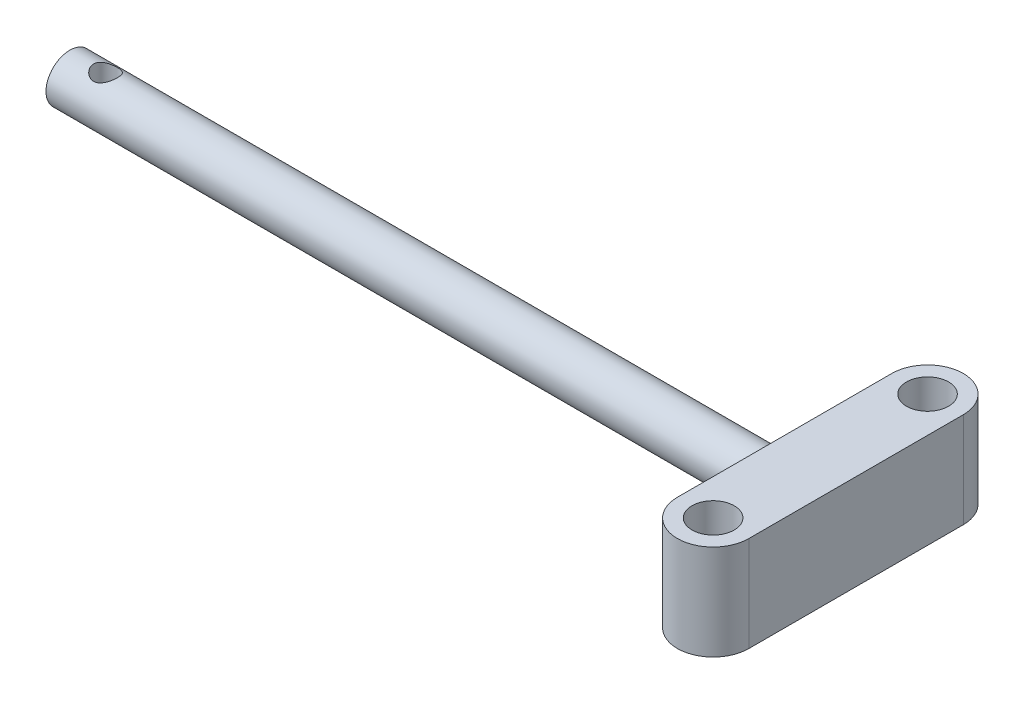
ISO-10303-21;
HEADER;
FILE_DESCRIPTION(('STEP AP214'),'2;1');
FILE_NAME('part.step','',(''),(''),'','','');
FILE_SCHEMA(('AUTOMOTIVE_DESIGN { 1 0 10303 214 1 1 1 1 }'));
ENDSEC;
DATA;
#1=APPLICATION_CONTEXT('core data for automotive mechanical design processes');
#2=APPLICATION_PROTOCOL_DEFINITION('international standard','automotive_design',2000,#1);
#3=PRODUCT_CONTEXT('',#1,'mechanical');
#4=PRODUCT('Part','Part','',(#3));
#5=PRODUCT_RELATED_PRODUCT_CATEGORY('part','',(#4));
#6=PRODUCT_DEFINITION_FORMATION('','',#4);
#7=PRODUCT_DEFINITION_CONTEXT('part definition',#1,'design');
#8=PRODUCT_DEFINITION('design','',#6,#7);
#9=PRODUCT_DEFINITION_SHAPE('','',#8);
#10=(LENGTH_UNIT() NAMED_UNIT(*) SI_UNIT(.MILLI.,.METRE.));
#11=(NAMED_UNIT(*) PLANE_ANGLE_UNIT() SI_UNIT($,.RADIAN.));
#12=(NAMED_UNIT(*) SI_UNIT($,.STERADIAN.) SOLID_ANGLE_UNIT());
#13=UNCERTAINTY_MEASURE_WITH_UNIT(LENGTH_MEASURE(1.E-05),#10,'distance_accuracy_value','');
#14=(GEOMETRIC_REPRESENTATION_CONTEXT(3) GLOBAL_UNCERTAINTY_ASSIGNED_CONTEXT((#13)) GLOBAL_UNIT_ASSIGNED_CONTEXT((#10,
#11,#12)) REPRESENTATION_CONTEXT('',''));
#15=CARTESIAN_POINT('',(0.,0.,0.));
#16=DIRECTION('',(0.,0.,1.));
#17=DIRECTION('',(1.,0.,0.));
#18=AXIS2_PLACEMENT_3D('',#15,#16,#17);
#19=CARTESIAN_POINT('',(-50.9353379952085,5.08,2.13805652694152));
#20=DIRECTION('',(1.,0.,0.));
#21=DIRECTION('',(0.,0.,-1.));
#22=AXIS2_PLACEMENT_3D('',#19,#20,#21);
#23=PLANE('',#22);
#24=CARTESIAN_POINT('',(-50.9353379952085,0.,0.));
#25=DIRECTION('',(1.,0.,0.));
#26=DIRECTION('',(0.,0.,-1.));
#27=AXIS2_PLACEMENT_3D('',#24,#25,#26);
#28=CIRCLE('',#27,2.54);
#29=CARTESIAN_POINT('',(-50.9353379952085,0.,-2.54000000000004));
#30=VERTEX_POINT('',#29);
#31=EDGE_CURVE('E11',#30,#30,#28,.F.);
#32=ORIENTED_EDGE('',*,*,#31,.F.);
#33=EDGE_LOOP('',(#32));
#34=FACE_BOUND('',#33,.T.);
#35=DIRECTION('',(0.,0.,1.));
#36=VECTOR('',#35,1.);
#37=CARTESIAN_POINT('',(-50.9353379952085,-5.08,2.13805652694152));
#38=LINE('',#37,#36);
#39=CARTESIAN_POINT('',(-50.9353379952085,-5.08,-11.43));
#40=VERTEX_POINT('',#39);
#41=CARTESIAN_POINT('',(-50.9353379952085,-5.08,11.43));
#42=VERTEX_POINT('',#41);
#43=EDGE_CURVE('E77',#40,#42,#38,.T.);
#44=ORIENTED_EDGE('',*,*,#43,.T.);
#45=DIRECTION('',(0.,-1.,0.));
#46=VECTOR('',#45,1.);
#47=CARTESIAN_POINT('',(-50.9353379952085,5.08,11.43));
#48=LINE('',#47,#46);
#49=CARTESIAN_POINT('',(-50.9353379952085,5.08,11.43));
#50=VERTEX_POINT('',#49);
#51=EDGE_CURVE('E45',#50,#42,#48,.T.);
#52=ORIENTED_EDGE('',*,*,#51,.F.);
#53=DIRECTION('',(0.,0.,1.));
#54=VECTOR('',#53,1.);
#55=CARTESIAN_POINT('',(-50.9353379952085,5.08,-11.43));
#56=LINE('',#55,#54);
#57=CARTESIAN_POINT('',(-50.9353379952085,5.08,-11.43));
#58=VERTEX_POINT('',#57);
#59=EDGE_CURVE('E82',#58,#50,#56,.T.);
#60=ORIENTED_EDGE('',*,*,#59,.F.);
#61=DIRECTION('',(0.,-1.,0.));
#62=VECTOR('',#61,1.);
#63=CARTESIAN_POINT('',(-50.9353379952085,5.08,-11.43));
#64=LINE('',#63,#62);
#65=EDGE_CURVE('E100',#58,#40,#64,.T.);
#66=ORIENTED_EDGE('',*,*,#65,.T.);
#67=EDGE_LOOP('',(#44,#52,#60,#66));
#68=FACE_BOUND('',#67,.T.);
#69=ADVANCED_FACE('F37',(#34,#68),#23,.F.);
#70=CARTESIAN_POINT('',(-47.1253379952085,5.08,11.43));
#71=DIRECTION('',(0.,-1.,0.));
#72=DIRECTION('',(0.,0.,-1.));
#73=AXIS2_PLACEMENT_3D('',#70,#71,#72);
#74=CYLINDRICAL_SURFACE('',#73,3.81);
#75=CARTESIAN_POINT('',(-47.1253379952085,-5.08,11.43));
#76=DIRECTION('',(0.,1.,0.));
#77=DIRECTION('',(0.,0.,1.));
#78=AXIS2_PLACEMENT_3D('',#75,#76,#77);
#79=CIRCLE('',#78,3.81);
#80=CARTESIAN_POINT('',(-43.3153379952085,-5.08,11.43));
#81=VERTEX_POINT('',#80);
#82=EDGE_CURVE('E95',#42,#81,#79,.T.);
#83=ORIENTED_EDGE('',*,*,#82,.T.);
#84=DIRECTION('',(0.,-1.,0.));
#85=VECTOR('',#84,1.);
#86=CARTESIAN_POINT('',(-43.3153379952085,5.08,11.43));
#87=LINE('',#86,#85);
#88=CARTESIAN_POINT('',(-43.3153379952085,5.08,11.43));
#89=VERTEX_POINT('',#88);
#90=EDGE_CURVE('E93',#89,#81,#87,.T.);
#91=ORIENTED_EDGE('',*,*,#90,.F.);
#92=CARTESIAN_POINT('',(-47.1253379952085,5.08,11.43));
#93=DIRECTION('',(0.,1.,0.));
#94=DIRECTION('',(0.,0.,1.));
#95=AXIS2_PLACEMENT_3D('',#92,#93,#94);
#96=CIRCLE('',#95,3.81);
#97=EDGE_CURVE('E85',#50,#89,#96,.T.);
#98=ORIENTED_EDGE('',*,*,#97,.F.);
#99=ORIENTED_EDGE('',*,*,#51,.T.);
#100=EDGE_LOOP('',(#83,#91,#98,#99));
#101=FACE_BOUND('',#100,.T.);
#102=ADVANCED_FACE('F94',(#101),#74,.T.);
#103=CARTESIAN_POINT('',(-43.3153379952085,5.08,-11.43));
#104=DIRECTION('',(-1.,0.,0.));
#105=DIRECTION('',(0.,0.,1.));
#106=AXIS2_PLACEMENT_3D('',#103,#104,#105);
#107=PLANE('',#106);
#108=DIRECTION('',(0.,0.,-1.));
#109=VECTOR('',#108,1.);
#110=CARTESIAN_POINT('',(-43.3153379952085,-5.08,-11.43));
#111=LINE('',#110,#109);
#112=CARTESIAN_POINT('',(-43.3153379952085,-5.08,-11.43));
#113=VERTEX_POINT('',#112);
#114=EDGE_CURVE('E70',#81,#113,#111,.T.);
#115=ORIENTED_EDGE('',*,*,#114,.T.);
#116=DIRECTION('',(0.,-1.,0.));
#117=VECTOR('',#116,1.);
#118=CARTESIAN_POINT('',(-43.3153379952085,5.08,-11.43));
#119=LINE('',#118,#117);
#120=CARTESIAN_POINT('',(-43.3153379952085,5.08,-11.43));
#121=VERTEX_POINT('',#120);
#122=EDGE_CURVE('E96',#121,#113,#119,.T.);
#123=ORIENTED_EDGE('',*,*,#122,.F.);
#124=DIRECTION('',(0.,0.,-1.));
#125=VECTOR('',#124,1.);
#126=CARTESIAN_POINT('',(-43.3153379952085,5.08,-11.43));
#127=LINE('',#126,#125);
#128=EDGE_CURVE('E89',#89,#121,#127,.T.);
#129=ORIENTED_EDGE('',*,*,#128,.F.);
#130=ORIENTED_EDGE('',*,*,#90,.T.);
#131=EDGE_LOOP('',(#115,#123,#129,#130));
#132=FACE_BOUND('',#131,.T.);
#133=ADVANCED_FACE('F98',(#132),#107,.F.);
#134=CARTESIAN_POINT('',(-47.1253379952085,5.08,-11.43));
#135=DIRECTION('',(0.,-1.,0.));
#136=DIRECTION('',(0.,0.,-1.));
#137=AXIS2_PLACEMENT_3D('',#134,#135,#136);
#138=CYLINDRICAL_SURFACE('',#137,3.81);
#139=CARTESIAN_POINT('',(-47.1253379952085,-5.08,-11.43));
#140=DIRECTION('',(0.,1.,0.));
#141=DIRECTION('',(0.,0.,-1.));
#142=AXIS2_PLACEMENT_3D('',#139,#140,#141);
#143=CIRCLE('',#142,3.81);
#144=EDGE_CURVE('E108',#113,#40,#143,.T.);
#145=ORIENTED_EDGE('',*,*,#144,.T.);
#146=ORIENTED_EDGE('',*,*,#65,.F.);
#147=CARTESIAN_POINT('',(-47.1253379952085,5.08,-11.43));
#148=DIRECTION('',(0.,1.,0.));
#149=DIRECTION('',(0.,0.,-1.));
#150=AXIS2_PLACEMENT_3D('',#147,#148,#149);
#151=CIRCLE('',#150,3.81);
#152=EDGE_CURVE('E53',#121,#58,#151,.T.);
#153=ORIENTED_EDGE('',*,*,#152,.F.);
#154=ORIENTED_EDGE('',*,*,#122,.T.);
#155=EDGE_LOOP('',(#145,#146,#153,#154));
#156=FACE_BOUND('',#155,.T.);
#157=ADVANCED_FACE('F115',(#156),#138,.T.);
#158=CARTESIAN_POINT('',(-47.1253379952085,5.08,11.43));
#159=DIRECTION('',(0.,1.,0.));
#160=DIRECTION('',(0.,0.,1.));
#161=AXIS2_PLACEMENT_3D('',#158,#159,#160);
#162=PLANE('',#161);
#163=CARTESIAN_POINT('',(-47.1253379952085,5.08,-11.43));
#164=DIRECTION('',(0.,1.,0.));
#165=DIRECTION('',(0.,0.,1.));
#166=AXIS2_PLACEMENT_3D('',#163,#164,#165);
#167=CIRCLE('',#166,2.2479);
#168=CARTESIAN_POINT('',(-47.1253379952085,5.08,-9.1821));
#169=VERTEX_POINT('',#168);
#170=EDGE_CURVE('E120',#169,#169,#167,.T.);
#171=ORIENTED_EDGE('',*,*,#170,.F.);
#172=EDGE_LOOP('',(#171));
#173=FACE_BOUND('',#172,.T.);
#174=CARTESIAN_POINT('',(-47.1253379952085,5.08,11.43));
#175=DIRECTION('',(0.,1.,0.));
#176=DIRECTION('',(0.,0.,1.));
#177=AXIS2_PLACEMENT_3D('',#174,#175,#176);
#178=CIRCLE('',#177,2.2479);
#179=CARTESIAN_POINT('',(-47.1253379952085,5.08,13.6779));
#180=VERTEX_POINT('',#179);
#181=EDGE_CURVE('E121',#180,#180,#178,.T.);
#182=ORIENTED_EDGE('',*,*,#181,.F.);
#183=EDGE_LOOP('',(#182));
#184=FACE_BOUND('',#183,.T.);
#185=ORIENTED_EDGE('',*,*,#59,.T.);
#186=ORIENTED_EDGE('',*,*,#97,.T.);
#187=ORIENTED_EDGE('',*,*,#128,.T.);
#188=ORIENTED_EDGE('',*,*,#152,.T.);
#189=EDGE_LOOP('',(#185,#186,#187,#188));
#190=FACE_BOUND('',#189,.T.);
#191=ADVANCED_FACE('F87',(#173,#184,#190),#162,.T.);
#192=CARTESIAN_POINT('',(-47.1253379952085,-5.08,11.43));
#193=DIRECTION('',(0.,1.,0.));
#194=DIRECTION('',(0.,0.,1.));
#195=AXIS2_PLACEMENT_3D('',#192,#193,#194);
#196=PLANE('',#195);
#197=CARTESIAN_POINT('',(-47.1253379952085,-5.08,-11.43));
#198=DIRECTION('',(0.,1.,0.));
#199=DIRECTION('',(0.,0.,1.));
#200=AXIS2_PLACEMENT_3D('',#197,#198,#199);
#201=CIRCLE('',#200,2.2479);
#202=CARTESIAN_POINT('',(-47.1253379952085,-5.08,-9.1821));
#203=VERTEX_POINT('',#202);
#204=EDGE_CURVE('E105',#203,#203,#201,.F.);
#205=ORIENTED_EDGE('',*,*,#204,.F.);
#206=EDGE_LOOP('',(#205));
#207=FACE_BOUND('',#206,.T.);
#208=CARTESIAN_POINT('',(-47.1253379952085,-5.08,11.43));
#209=DIRECTION('',(0.,1.,0.));
#210=DIRECTION('',(0.,0.,1.));
#211=AXIS2_PLACEMENT_3D('',#208,#209,#210);
#212=CIRCLE('',#211,2.2479);
#213=CARTESIAN_POINT('',(-47.1253379952085,-5.08,13.6779));
#214=VERTEX_POINT('',#213);
#215=EDGE_CURVE('E117',#214,#214,#212,.F.);
#216=ORIENTED_EDGE('',*,*,#215,.F.);
#217=EDGE_LOOP('',(#216));
#218=FACE_BOUND('',#217,.T.);
#219=ORIENTED_EDGE('',*,*,#43,.F.);
#220=ORIENTED_EDGE('',*,*,#144,.F.);
#221=ORIENTED_EDGE('',*,*,#114,.F.);
#222=ORIENTED_EDGE('',*,*,#82,.F.);
#223=EDGE_LOOP('',(#219,#220,#221,#222));
#224=FACE_BOUND('',#223,.T.);
#225=ADVANCED_FACE('F113',(#207,#218,#224),#196,.F.);
#226=CARTESIAN_POINT('',(-47.1253379952085,-5.081,11.43));
#227=DIRECTION('',(0.,1.,0.));
#228=DIRECTION('',(0.,0.,1.));
#229=AXIS2_PLACEMENT_3D('',#226,#227,#228);
#230=CYLINDRICAL_SURFACE('',#229,2.2479);
#231=ORIENTED_EDGE('',*,*,#181,.T.);
#232=EDGE_LOOP('',(#231));
#233=FACE_BOUND('',#232,.T.);
#234=ORIENTED_EDGE('',*,*,#215,.T.);
#235=EDGE_LOOP('',(#234));
#236=FACE_BOUND('',#235,.T.);
#237=ADVANCED_FACE('F162',(#233,#236),#230,.F.);
#238=CARTESIAN_POINT('',(-47.1253379952085,-5.081,-11.43));
#239=DIRECTION('',(0.,1.,0.));
#240=DIRECTION('',(0.,0.,1.));
#241=AXIS2_PLACEMENT_3D('',#238,#239,#240);
#242=CYLINDRICAL_SURFACE('',#241,2.2479);
#243=ORIENTED_EDGE('',*,*,#170,.T.);
#244=EDGE_LOOP('',(#243));
#245=FACE_BOUND('',#244,.T.);
#246=ORIENTED_EDGE('',*,*,#204,.T.);
#247=EDGE_LOOP('',(#246));
#248=FACE_BOUND('',#247,.T.);
#249=ADVANCED_FACE('F158',(#245,#248),#242,.F.);
#250=CARTESIAN_POINT('',(-127.135337995209,0.,0.));
#251=DIRECTION('',(1.,0.,0.));
#252=DIRECTION('',(0.,0.,-1.));
#253=AXIS2_PLACEMENT_3D('',#250,#251,#252);
#254=CYLINDRICAL_SURFACE('',#253,2.54);
#255=CARTESIAN_POINT('',(-123.325337995209,-2.19970452561246,1.26999999999999));
#256=CARTESIAN_POINT('',(-123.391514911617,-2.19971029105141,1.26999538110465));
#257=CARTESIAN_POINT('',(-123.457775387845,-2.20273627508449,1.26479296283118));
#258=CARTESIAN_POINT('',(-123.588262621349,-2.21440205394105,1.24424847657052));
#259=CARTESIAN_POINT('',(-123.652484807314,-2.22305364450559,1.2288851019838));
#260=CARTESIAN_POINT('',(-123.776761608925,-2.24471670188854,1.18884693484876));
#261=CARTESIAN_POINT('',(-123.83683640385,-2.25770495211028,1.16422163966703));
#262=CARTESIAN_POINT('',(-123.951986731744,-2.28654184317408,1.10650975722799));
#263=CARTESIAN_POINT('',(-124.007061994042,-2.302390638746,1.07342271222543));
#264=CARTESIAN_POINT('',(-124.115666270477,-2.33676023702949,0.99652650647421));
#265=CARTESIAN_POINT('',(-124.168693097514,-2.355393608202,0.952058085902584));
#266=CARTESIAN_POINT('',(-124.266926648485,-2.39232418137845,0.855032335670376));
#267=CARTESIAN_POINT('',(-124.31212947169,-2.41062121165686,0.802470995743518));
#268=CARTESIAN_POINT('',(-124.396414277166,-2.44629275730244,0.686421745536485));
#269=CARTESIAN_POINT('',(-124.43487828039,-2.46352195151078,0.622436130045982));
#270=CARTESIAN_POINT('',(-124.500266878831,-2.49365460246401,0.487879423781382));
#271=CARTESIAN_POINT('',(-124.527198756503,-2.50656078803351,0.417312523435468));
#272=CARTESIAN_POINT('',(-124.566768915061,-2.52578185780181,0.276917078786002));
#273=CARTESIAN_POINT('',(-124.58028789368,-2.53250039880532,0.20739327392081));
#274=CARTESIAN_POINT('',(-124.595548965926,-2.54009631484505,0.0667646984462789));
#275=CARTESIAN_POINT('',(-124.597298185339,-2.54097722416429,-0.00433908942153634));
#276=CARTESIAN_POINT('',(-124.589309719266,-2.53698987033892,-0.139487306018152));
#277=CARTESIAN_POINT('',(-124.580557715497,-2.53261489783044,-0.203607922954515));
#278=CARTESIAN_POINT('',(-124.55357932345,-2.5193529147988,-0.329328490336259));
#279=CARTESIAN_POINT('',(-124.535352226209,-2.51046556664321,-0.390928251789275));
#280=CARTESIAN_POINT('',(-124.489823136274,-2.48883910775322,-0.510932927293322));
#281=CARTESIAN_POINT('',(-124.46239907748,-2.47604840742084,-0.569281847864265));
#282=CARTESIAN_POINT('',(-124.399423456633,-2.44776810403094,-0.680690537921915));
#283=CARTESIAN_POINT('',(-124.363868984815,-2.43227753520006,-0.733748404025069));
#284=CARTESIAN_POINT('',(-124.281780898762,-2.39832380887023,-0.838420549340696));
#285=CARTESIAN_POINT('',(-124.234527149235,-2.37971807517684,-0.889424275287276));
#286=CARTESIAN_POINT('',(-124.132309044547,-2.34257012545253,-0.983112550278171));
#287=CARTESIAN_POINT('',(-124.07733881242,-2.32402796897351,-1.02579069869926));
#288=CARTESIAN_POINT('',(-123.95697479083,-2.28783078237458,-1.1042717749956));
#289=CARTESIAN_POINT('',(-123.89114074593,-2.27030686388201,-1.13946599002212));
#290=CARTESIAN_POINT('',(-123.753407152583,-2.23996821853794,-1.19801527351155));
#291=CARTESIAN_POINT('',(-123.681514025276,-2.22714858158508,-1.22138269592782));
#292=CARTESIAN_POINT('',(-123.539695565879,-2.20909687487637,-1.25371886800179));
#293=CARTESIAN_POINT('',(-123.470065774023,-2.20334402927593,-1.26368190509236));
#294=CARTESIAN_POINT('',(-123.329908291483,-2.19859757589247,-1.2719265221965));
#295=CARTESIAN_POINT('',(-123.259381270226,-2.19959919349428,-1.27021635379007));
#296=CARTESIAN_POINT('',(-123.127657518614,-2.20769607406545,-1.25607577504683));
#297=CARTESIAN_POINT('',(-123.066284092301,-2.21411276133453,-1.24483852722482));
#298=CARTESIAN_POINT('',(-122.946410906644,-2.23131407370206,-1.21373428148319));
#299=CARTESIAN_POINT('',(-122.88791208476,-2.24210011326395,-1.19386448885198));
#300=CARTESIAN_POINT('',(-122.772365604962,-2.26741002041166,-1.1450924375282));
#301=CARTESIAN_POINT('',(-122.715510643805,-2.28208386918693,-1.11581446088975));
#302=CARTESIAN_POINT('',(-122.607192020354,-2.31338271761509,-1.04938457130006));
#303=CARTESIAN_POINT('',(-122.555731147947,-2.33000871761039,-1.01222861350191));
#304=CARTESIAN_POINT('',(-122.452874960454,-2.36585758039548,-0.925623202342537));
#305=CARTESIAN_POINT('',(-122.402305613797,-2.38514360605949,-0.875214495840001));
#306=CARTESIAN_POINT('',(-122.310084452957,-2.42232478421925,-0.766323709155821));
#307=CARTESIAN_POINT('',(-122.268435651016,-2.44021946559792,-0.707838912812286));
#308=CARTESIAN_POINT('',(-122.194309363252,-2.47321529347516,-0.582339910449619));
#309=CARTESIAN_POINT('',(-122.162102935081,-2.48823024923478,-0.515141333919123));
#310=CARTESIAN_POINT('',(-122.10977285731,-2.51311860798313,-0.375313403094176));
#311=CARTESIAN_POINT('',(-122.089638597973,-2.52299652468994,-0.302688880768066));
#312=CARTESIAN_POINT('',(-122.063759918707,-2.53577735390991,-0.161264196559635));
#313=CARTESIAN_POINT('',(-122.056864692846,-2.53923708443403,-0.092724533690086));
#314=CARTESIAN_POINT('',(-122.054267048081,-2.54053505576417,0.0446100021580216));
#315=CARTESIAN_POINT('',(-122.058560710984,-2.5383752644495,0.113404777374753));
#316=CARTESIAN_POINT('',(-122.077456831839,-2.52900140424161,0.244523250242768));
#317=CARTESIAN_POINT('',(-122.091361353766,-2.52212976228347,0.306974643620296));
#318=CARTESIAN_POINT('',(-122.128143284323,-2.50433958952547,0.428556359273184));
#319=CARTESIAN_POINT('',(-122.151021979727,-2.4934204783865,0.487686203893486));
#320=CARTESIAN_POINT('',(-122.206121351459,-2.46793932050112,0.603787725930992));
#321=CARTESIAN_POINT('',(-122.238699735683,-2.45324143842474,0.660558931229047));
#322=CARTESIAN_POINT('',(-122.3118245674,-2.42173929090118,0.768063795103799));
#323=CARTESIAN_POINT('',(-122.352374674585,-2.40493405929117,0.818794663416919));
#324=CARTESIAN_POINT('',(-122.444970361767,-2.36891334987816,0.918100785279238));
#325=CARTESIAN_POINT('',(-122.497758354305,-2.34962444744856,0.965959059364859));
#326=CARTESIAN_POINT('',(-122.610900411043,-2.31220106726821,1.05240237499122));
#327=CARTESIAN_POINT('',(-122.671261097711,-2.29406762117568,1.09097921251276));
#328=CARTESIAN_POINT('',(-122.800366536366,-2.26059498737242,1.15878747132777));
#329=CARTESIAN_POINT('',(-122.869315959742,-2.24536221305462,1.18768503377038));
#330=CARTESIAN_POINT('',(-123.01207014872,-2.22080018537005,1.23301596107313));
#331=CARTESIAN_POINT('',(-123.085857764128,-2.2114512050758,1.24949101279268));
#332=CARTESIAN_POINT('',(-123.187930796887,-2.20382176204272,1.2628460999878));
#333=CARTESIAN_POINT('',(-123.215315221094,-2.20228323836541,1.26552465330408));
#334=CARTESIAN_POINT('',(-123.270240925675,-2.20022338577441,1.26910262446424));
#335=CARTESIAN_POINT('',(-123.297782216419,-2.19970212490887,1.27000192328783));
#336=CARTESIAN_POINT('',(-123.325337995209,-2.19970452561246,1.26999999999999));
#337=B_SPLINE_CURVE_WITH_KNOTS('',3,(#255,#256,#257,#258,#259,#260,#261,#262,#263,#264,#265,
#266,#267,#268,#269,#270,#271,#272,#273,#274,#275,#276,#277,#278,#279,#280,#281,#282,#283,#284,
#285,#286,#287,#288,#289,#290,#291,#292,#293,#294,#295,#296,#297,#298,#299,#300,#301,#302,#303,
#304,#305,#306,#307,#308,#309,#310,#311,#312,#313,#314,#315,#316,#317,#318,#319,#320,#321,#322,
#323,#324,#325,#326,#327,#328,#329,#330,#331,#332,#333,#334,#335,#336),.UNSPECIFIED.,.T.,.F.,(4,
2,2,2,2,2,2,2,2,2,2,2,2,2,2,2,2,2,2,2,2,2,2,2,2,2,2,2,2,2,2,2,2,2,2,2,2,2,2,2,4),(0.,
0.198414795695288,0.39724697388749,0.595031316816976,0.792826361315331,1.00693513687275,
1.22115035277149,1.44980523143227,1.67831550244139,1.89056625909275,2.10268850081268,
2.29636443805361,2.49005486897166,2.68642509108554,2.88286570174842,3.09787533150248,
3.31304961272314,3.54188828996396,3.7704874324886,3.98097109384844,4.19130598349229,
4.37863212948511,4.56601896593797,4.76208466435727,4.95825127499456,5.17914564347374,
5.40011448522313,5.62691510394462,5.85351610357134,6.05932583394643,6.26506350228338,
6.4572441958679,6.6494524556025,6.84988153413723,7.05040284227907,7.27088007149579,
7.4915514741334,7.71919651279022,7.94607418913499,8.02868771685339,8.1113067706806),.UNSPECIFIED.);
#338=CARTESIAN_POINT('',(-123.325337995209,-2.19970452561246,1.26999999999999));
#339=VERTEX_POINT('',#338);
#340=EDGE_CURVE('E131',#339,#339,#337,.T.);
#341=ORIENTED_EDGE('',*,*,#340,.F.);
#342=EDGE_LOOP('',(#341));
#343=FACE_BOUND('',#342,.T.);
#344=CARTESIAN_POINT('',(-123.325337995209,2.19970452561246,1.26999999999999));
#345=CARTESIAN_POINT('',(-123.259161078801,2.19971029105142,1.26999538110465));
#346=CARTESIAN_POINT('',(-123.192900602572,2.20273627508449,1.26479296283118));
#347=CARTESIAN_POINT('',(-123.062413369069,2.21440205394105,1.24424847657052));
#348=CARTESIAN_POINT('',(-122.998191183103,2.22305364450559,1.2288851019838));
#349=CARTESIAN_POINT('',(-122.873914381492,2.24471670188854,1.18884693484876));
#350=CARTESIAN_POINT('',(-122.813839586567,2.25770495211028,1.16422163966703));
#351=CARTESIAN_POINT('',(-122.698689258673,2.28654184317408,1.10650975722799));
#352=CARTESIAN_POINT('',(-122.643613996375,2.30239063874601,1.07342271222543));
#353=CARTESIAN_POINT('',(-122.535009719941,2.33676023702949,0.996526506474214));
#354=CARTESIAN_POINT('',(-122.481982892903,2.35539360820199,0.952058085902592));
#355=CARTESIAN_POINT('',(-122.383749341932,2.39232418137844,0.855032335670385));
#356=CARTESIAN_POINT('',(-122.338546518727,2.41062121165686,0.802470995743523));
#357=CARTESIAN_POINT('',(-122.254261713251,2.44629275730244,0.686421745536486));
#358=CARTESIAN_POINT('',(-122.215797710027,2.46352195151078,0.622436130045982));
#359=CARTESIAN_POINT('',(-122.150409111586,2.49365460246401,0.487879423781382));
#360=CARTESIAN_POINT('',(-122.123477233914,2.50656078803351,0.417312523435468));
#361=CARTESIAN_POINT('',(-122.083907075356,2.52578185780181,0.276917078786002));
#362=CARTESIAN_POINT('',(-122.070388096737,2.53250039880532,0.20739327392081));
#363=CARTESIAN_POINT('',(-122.055127024491,2.54009631484505,0.0667646984462791));
#364=CARTESIAN_POINT('',(-122.053377805078,2.54097722416429,-0.00433908942153612));
#365=CARTESIAN_POINT('',(-122.061366271151,2.53698987033892,-0.139487306018152));
#366=CARTESIAN_POINT('',(-122.070118274921,2.53261489783044,-0.203607922954515));
#367=CARTESIAN_POINT('',(-122.097096666967,2.5193529147988,-0.329328490336259));
#368=CARTESIAN_POINT('',(-122.115323764208,2.51046556664321,-0.390928251789275));
#369=CARTESIAN_POINT('',(-122.160852854143,2.48883910775322,-0.510932927293322));
#370=CARTESIAN_POINT('',(-122.188276912937,2.47604840742084,-0.569281847864266));
#371=CARTESIAN_POINT('',(-122.251252533784,2.44776810403094,-0.680690537921916));
#372=CARTESIAN_POINT('',(-122.286807005603,2.43227753520006,-0.733748404025067));
#373=CARTESIAN_POINT('',(-122.368895091655,2.39832380887023,-0.838420549340693));
#374=CARTESIAN_POINT('',(-122.416148841183,2.37971807517684,-0.889424275287274));
#375=CARTESIAN_POINT('',(-122.51836694587,2.34257012545253,-0.983112550278167));
#376=CARTESIAN_POINT('',(-122.573337177997,2.32402796897351,-1.02579069869926));
#377=CARTESIAN_POINT('',(-122.693701199587,2.28783078237458,-1.10427177499559));
#378=CARTESIAN_POINT('',(-122.759535244487,2.27030686388201,-1.13946599002211));
#379=CARTESIAN_POINT('',(-122.897268837834,2.23996821853794,-1.19801527351155));
#380=CARTESIAN_POINT('',(-122.969161965141,2.22714858158508,-1.22138269592781));
#381=CARTESIAN_POINT('',(-123.110980424538,2.20909687487637,-1.25371886800179));
#382=CARTESIAN_POINT('',(-123.180610216394,2.20334402927593,-1.26368190509236));
#383=CARTESIAN_POINT('',(-123.320767698935,2.19859757589247,-1.2719265221965));
#384=CARTESIAN_POINT('',(-123.391294720191,2.19959919349428,-1.27021635379007));
#385=CARTESIAN_POINT('',(-123.523018471804,2.20769607406545,-1.25607577504683));
#386=CARTESIAN_POINT('',(-123.584391898116,2.21411276133453,-1.24483852722482));
#387=CARTESIAN_POINT('',(-123.704265083773,2.23131407370206,-1.21373428148319));
#388=CARTESIAN_POINT('',(-123.762763905657,2.24210011326396,-1.19386448885198));
#389=CARTESIAN_POINT('',(-123.878310385455,2.26741002041167,-1.14509243752819));
#390=CARTESIAN_POINT('',(-123.935165346613,2.28208386918693,-1.11581446088974));
#391=CARTESIAN_POINT('',(-124.043483970063,2.31338271761509,-1.04938457130006));
#392=CARTESIAN_POINT('',(-124.09494484247,2.3300087176104,-1.0122286135019));
#393=CARTESIAN_POINT('',(-124.197801029963,2.36585758039549,-0.925623202342535));
#394=CARTESIAN_POINT('',(-124.24837037662,2.38514360605949,-0.875214495839997));
#395=CARTESIAN_POINT('',(-124.34059153746,2.42232478421925,-0.766323709155816));
#396=CARTESIAN_POINT('',(-124.382240339401,2.44021946559792,-0.707838912812283));
#397=CARTESIAN_POINT('',(-124.456366627165,2.47321529347516,-0.58233991044962));
#398=CARTESIAN_POINT('',(-124.488573055336,2.48823024923478,-0.515141333919125));
#399=CARTESIAN_POINT('',(-124.540903133107,2.51311860798313,-0.375313403094178));
#400=CARTESIAN_POINT('',(-124.561037392444,2.52299652468994,-0.302688880768067));
#401=CARTESIAN_POINT('',(-124.58691607171,2.53577735390991,-0.161264196559633));
#402=CARTESIAN_POINT('',(-124.593811297571,2.53923708443403,-0.0927245336900846));
#403=CARTESIAN_POINT('',(-124.596408942336,2.54053505576417,0.0446100021580234));
#404=CARTESIAN_POINT('',(-124.592115279433,2.5383752644495,0.113404777374755));
#405=CARTESIAN_POINT('',(-124.573219158578,2.52900140424161,0.244523250242771));
#406=CARTESIAN_POINT('',(-124.559314636651,2.52212976228347,0.306974643620299));
#407=CARTESIAN_POINT('',(-124.522532706094,2.50433958952547,0.428556359273188));
#408=CARTESIAN_POINT('',(-124.49965401069,2.4934204783865,0.48768620389349));
#409=CARTESIAN_POINT('',(-124.444554638958,2.46793932050112,0.603787725930996));
#410=CARTESIAN_POINT('',(-124.411976254735,2.45324143842474,0.660558931229049));
#411=CARTESIAN_POINT('',(-124.338851423018,2.42173929090118,0.768063795103801));
#412=CARTESIAN_POINT('',(-124.298301315832,2.40493405929117,0.818794663416922));
#413=CARTESIAN_POINT('',(-124.20570562865,2.36891334987816,0.918100785279248));
#414=CARTESIAN_POINT('',(-124.152917636112,2.34962444744855,0.965959059364876));
#415=CARTESIAN_POINT('',(-124.039775579374,2.31220106726821,1.05240237499124));
#416=CARTESIAN_POINT('',(-123.979414892707,2.29406762117567,1.09097921251277));
#417=CARTESIAN_POINT('',(-123.850309454051,2.26059498737242,1.15878747132777));
#418=CARTESIAN_POINT('',(-123.781360030675,2.24536221305461,1.18768503377039));
#419=CARTESIAN_POINT('',(-123.638605841697,2.22080018537005,1.23301596107314));
#420=CARTESIAN_POINT('',(-123.564818226289,2.2114512050758,1.24949101279268));
#421=CARTESIAN_POINT('',(-123.462745193531,2.20382176204272,1.2628460999878));
#422=CARTESIAN_POINT('',(-123.435360769323,2.20228323836541,1.26552465330408));
#423=CARTESIAN_POINT('',(-123.380435064742,2.20022338577441,1.26910262446424));
#424=CARTESIAN_POINT('',(-123.352893773998,2.19970212490887,1.27000192328783));
#425=CARTESIAN_POINT('',(-123.325337995209,2.19970452561246,1.26999999999999));
#426=B_SPLINE_CURVE_WITH_KNOTS('',3,(#344,#345,#346,#347,#348,#349,#350,#351,#352,#353,#354,
#355,#356,#357,#358,#359,#360,#361,#362,#363,#364,#365,#366,#367,#368,#369,#370,#371,#372,#373,
#374,#375,#376,#377,#378,#379,#380,#381,#382,#383,#384,#385,#386,#387,#388,#389,#390,#391,#392,
#393,#394,#395,#396,#397,#398,#399,#400,#401,#402,#403,#404,#405,#406,#407,#408,#409,#410,#411,
#412,#413,#414,#415,#416,#417,#418,#419,#420,#421,#422,#423,#424,#425),.UNSPECIFIED.,.T.,.F.,(4,
2,2,2,2,2,2,2,2,2,2,2,2,2,2,2,2,2,2,2,2,2,2,2,2,2,2,2,2,2,2,2,2,2,2,2,2,2,2,2,4),(0.,
0.198414795695274,0.39724697388749,0.595031316816976,0.792826361315331,1.00693513687273,
1.22115035277149,1.44980523143227,1.67831550244139,1.89056625909275,2.10268850081269,
2.29636443805361,2.49005486897166,2.68642509108554,2.88286570174843,3.09787533150248,
3.31304961272312,3.54188828996393,3.7704874324886,3.98097109384844,4.19130598349229,
4.37863212948509,4.56601896593799,4.76208466435729,4.95825127499457,5.17914564347375,
5.40011448522313,5.62691510394461,5.85351610357134,6.05932583394643,6.26506350228338,
6.4572441958679,6.64945245560251,6.84988153413724,7.05040284227908,7.27088007149581,
7.49155147413341,7.71919651279023,7.94607418913498,8.02868771685336,8.1113067706806),.UNSPECIFIED.);
#427=CARTESIAN_POINT('',(-123.325337995209,2.19970452561246,1.26999999999999));
#428=VERTEX_POINT('',#427);
#429=EDGE_CURVE('E139',#428,#428,#426,.T.);
#430=ORIENTED_EDGE('',*,*,#429,.F.);
#431=EDGE_LOOP('',(#430));
#432=FACE_BOUND('',#431,.T.);
#433=CARTESIAN_POINT('',(-127.135337995209,0.,0.));
#434=DIRECTION('',(-1.,0.,0.));
#435=DIRECTION('',(0.,0.,1.));
#436=AXIS2_PLACEMENT_3D('',#433,#434,#435);
#437=CIRCLE('',#436,2.54);
#438=CARTESIAN_POINT('',(-127.135337995209,0.,2.53999999999996));
#439=VERTEX_POINT('',#438);
#440=EDGE_CURVE('E124',#439,#439,#437,.T.);
#441=ORIENTED_EDGE('',*,*,#440,.F.);
#442=EDGE_LOOP('',(#441));
#443=FACE_BOUND('',#442,.T.);
#444=ORIENTED_EDGE('',*,*,#31,.T.);
#445=EDGE_LOOP('',(#444));
#446=FACE_BOUND('',#445,.T.);
#447=ADVANCED_FACE('F154',(#343,#432,#443,#446),#254,.T.);
#448=CARTESIAN_POINT('',(-127.135337995209,0.,0.));
#449=DIRECTION('',(-1.,0.,0.));
#450=DIRECTION('',(0.,0.,1.));
#451=AXIS2_PLACEMENT_3D('',#448,#449,#450);
#452=PLANE('',#451);
#453=ORIENTED_EDGE('',*,*,#440,.T.);
#454=EDGE_LOOP('',(#453));
#455=FACE_BOUND('',#454,.T.);
#456=ADVANCED_FACE('F149',(#455),#452,.T.);
#457=CARTESIAN_POINT('',(-123.325337995209,-5.081,0.));
#458=DIRECTION('',(0.,1.,0.));
#459=DIRECTION('',(0.,0.,1.));
#460=AXIS2_PLACEMENT_3D('',#457,#458,#459);
#461=CYLINDRICAL_SURFACE('',#460,1.26999999999999);
#462=ORIENTED_EDGE('',*,*,#429,.T.);
#463=EDGE_LOOP('',(#462));
#464=FACE_BOUND('',#463,.T.);
#465=ORIENTED_EDGE('',*,*,#340,.T.);
#466=EDGE_LOOP('',(#465));
#467=FACE_BOUND('',#466,.T.);
#468=ADVANCED_FACE('F143',(#464,#467),#461,.F.);
#469=CLOSED_SHELL('',(#69,#102,#133,#157,#191,#225,#237,#249,#447,#456,#468));
#470=MANIFOLD_SOLID_BREP('B2',#469);
#471=ADVANCED_BREP_SHAPE_REPRESENTATION('',(#18,#470),#14);
#472=SHAPE_DEFINITION_REPRESENTATION(#9,#471);
ENDSEC;
END-ISO-10303-21;
